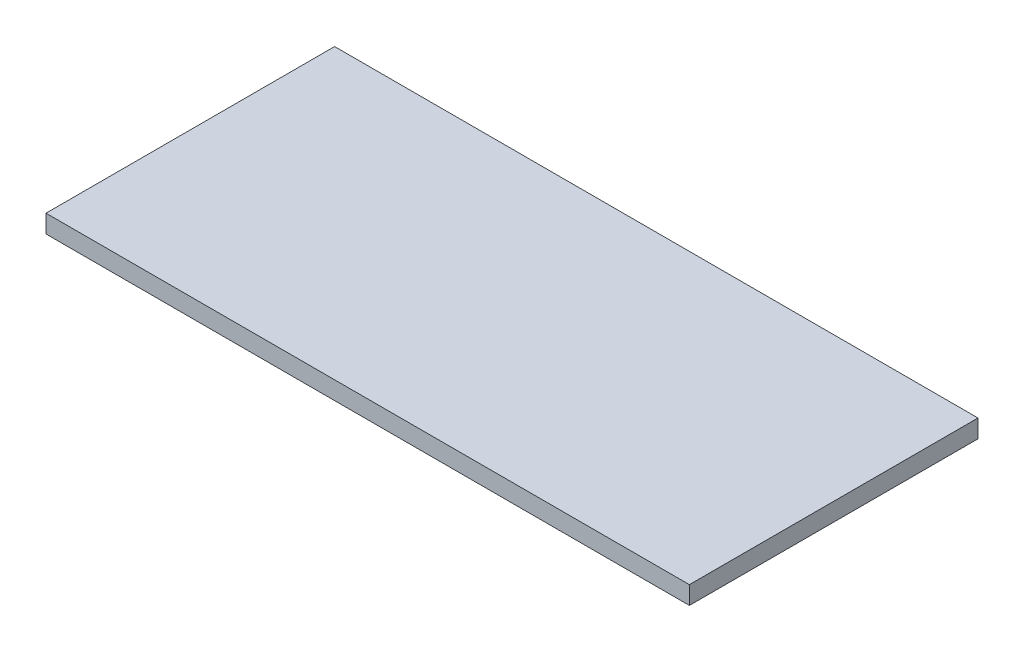
ISO-10303-21;
HEADER;
FILE_DESCRIPTION(('STEP AP214'),'2;1');
FILE_NAME('part.step','',(''),(''),'','','');
FILE_SCHEMA(('AUTOMOTIVE_DESIGN { 1 0 10303 214 1 1 1 1 }'));
ENDSEC;
DATA;
#1=APPLICATION_CONTEXT('core data for automotive mechanical design processes');
#2=APPLICATION_PROTOCOL_DEFINITION('international standard','automotive_design',2000,#1);
#3=PRODUCT_CONTEXT('',#1,'mechanical');
#4=PRODUCT('Part','Part','',(#3));
#5=PRODUCT_RELATED_PRODUCT_CATEGORY('part','',(#4));
#6=PRODUCT_DEFINITION_FORMATION('','',#4);
#7=PRODUCT_DEFINITION_CONTEXT('part definition',#1,'design');
#8=PRODUCT_DEFINITION('design','',#6,#7);
#9=PRODUCT_DEFINITION_SHAPE('','',#8);
#10=(LENGTH_UNIT() NAMED_UNIT(*) SI_UNIT(.MILLI.,.METRE.));
#11=(NAMED_UNIT(*) PLANE_ANGLE_UNIT() SI_UNIT($,.RADIAN.));
#12=(NAMED_UNIT(*) SI_UNIT($,.STERADIAN.) SOLID_ANGLE_UNIT());
#13=UNCERTAINTY_MEASURE_WITH_UNIT(LENGTH_MEASURE(1.E-05),#10,'distance_accuracy_value','');
#14=(GEOMETRIC_REPRESENTATION_CONTEXT(3) GLOBAL_UNCERTAINTY_ASSIGNED_CONTEXT((#13)) GLOBAL_UNIT_ASSIGNED_CONTEXT((#10,
#11,#12)) REPRESENTATION_CONTEXT('',''));
#15=CARTESIAN_POINT('',(0.,0.,0.));
#16=DIRECTION('',(0.,0.,1.));
#17=DIRECTION('',(1.,0.,0.));
#18=AXIS2_PLACEMENT_3D('',#15,#16,#17);
#19=CARTESIAN_POINT('',(-321.,18.,144.));
#20=DIRECTION('',(1.,0.,0.));
#21=DIRECTION('',(0.,0.,-1.));
#22=AXIS2_PLACEMENT_3D('',#19,#20,#21);
#23=PLANE('',#22);
#24=DIRECTION('',(0.,0.,1.));
#25=VECTOR('',#24,1.);
#26=CARTESIAN_POINT('',(-321.,0.,144.));
#27=LINE('',#26,#25);
#28=CARTESIAN_POINT('',(-321.,0.,-144.));
#29=VERTEX_POINT('',#28);
#30=CARTESIAN_POINT('',(-321.,0.,144.));
#31=VERTEX_POINT('',#30);
#32=EDGE_CURVE('E96',#29,#31,#27,.T.);
#33=ORIENTED_EDGE('',*,*,#32,.T.);
#34=DIRECTION('',(0.,-1.,0.));
#35=VECTOR('',#34,1.);
#36=CARTESIAN_POINT('',(-321.,18.,144.));
#37=LINE('',#36,#35);
#38=CARTESIAN_POINT('',(-321.,18.,144.));
#39=VERTEX_POINT('',#38);
#40=EDGE_CURVE('E11',#39,#31,#37,.T.);
#41=ORIENTED_EDGE('',*,*,#40,.F.);
#42=DIRECTION('',(0.,0.,1.));
#43=VECTOR('',#42,1.);
#44=CARTESIAN_POINT('',(-321.,18.,144.));
#45=LINE('',#44,#43);
#46=CARTESIAN_POINT('',(-321.,18.,-144.));
#47=VERTEX_POINT('',#46);
#48=EDGE_CURVE('E84',#47,#39,#45,.T.);
#49=ORIENTED_EDGE('',*,*,#48,.F.);
#50=DIRECTION('',(0.,-1.,0.));
#51=VECTOR('',#50,1.);
#52=CARTESIAN_POINT('',(-321.,18.,-144.));
#53=LINE('',#52,#51);
#54=EDGE_CURVE('E92',#47,#29,#53,.T.);
#55=ORIENTED_EDGE('',*,*,#54,.T.);
#56=EDGE_LOOP('',(#33,#41,#49,#55));
#57=FACE_BOUND('',#56,.T.);
#58=ADVANCED_FACE('F33',(#57),#23,.F.);
#59=CARTESIAN_POINT('',(321.,18.,144.));
#60=DIRECTION('',(0.,0.,-1.));
#61=DIRECTION('',(-1.,0.,0.));
#62=AXIS2_PLACEMENT_3D('',#59,#60,#61);
#63=PLANE('',#62);
#64=DIRECTION('',(1.,0.,0.));
#65=VECTOR('',#64,1.);
#66=CARTESIAN_POINT('',(321.,0.,144.));
#67=LINE('',#66,#65);
#68=CARTESIAN_POINT('',(321.,0.,144.));
#69=VERTEX_POINT('',#68);
#70=EDGE_CURVE('E88',#31,#69,#67,.T.);
#71=ORIENTED_EDGE('',*,*,#70,.T.);
#72=DIRECTION('',(0.,-1.,0.));
#73=VECTOR('',#72,1.);
#74=CARTESIAN_POINT('',(321.,18.,144.));
#75=LINE('',#74,#73);
#76=CARTESIAN_POINT('',(321.,18.,144.));
#77=VERTEX_POINT('',#76);
#78=EDGE_CURVE('E41',#77,#69,#75,.T.);
#79=ORIENTED_EDGE('',*,*,#78,.F.);
#80=DIRECTION('',(1.,0.,0.));
#81=VECTOR('',#80,1.);
#82=CARTESIAN_POINT('',(321.,18.,144.));
#83=LINE('',#82,#81);
#84=EDGE_CURVE('E79',#39,#77,#83,.T.);
#85=ORIENTED_EDGE('',*,*,#84,.F.);
#86=ORIENTED_EDGE('',*,*,#40,.T.);
#87=EDGE_LOOP('',(#71,#79,#85,#86));
#88=FACE_BOUND('',#87,.T.);
#89=ADVANCED_FACE('F87',(#88),#63,.F.);
#90=CARTESIAN_POINT('',(321.,18.,144.));
#91=DIRECTION('',(-1.,0.,0.));
#92=DIRECTION('',(0.,0.,1.));
#93=AXIS2_PLACEMENT_3D('',#90,#91,#92);
#94=PLANE('',#93);
#95=DIRECTION('',(0.,0.,-1.));
#96=VECTOR('',#95,1.);
#97=CARTESIAN_POINT('',(321.,0.,144.));
#98=LINE('',#97,#96);
#99=CARTESIAN_POINT('',(321.,0.,-144.));
#100=VERTEX_POINT('',#99);
#101=EDGE_CURVE('E66',#69,#100,#98,.T.);
#102=ORIENTED_EDGE('',*,*,#101,.T.);
#103=DIRECTION('',(0.,-1.,0.));
#104=VECTOR('',#103,1.);
#105=CARTESIAN_POINT('',(321.,18.,-144.));
#106=LINE('',#105,#104);
#107=CARTESIAN_POINT('',(321.,18.,-144.));
#108=VERTEX_POINT('',#107);
#109=EDGE_CURVE('E89',#108,#100,#106,.T.);
#110=ORIENTED_EDGE('',*,*,#109,.F.);
#111=DIRECTION('',(0.,0.,-1.));
#112=VECTOR('',#111,1.);
#113=CARTESIAN_POINT('',(321.,18.,144.));
#114=LINE('',#113,#112);
#115=EDGE_CURVE('E82',#77,#108,#114,.T.);
#116=ORIENTED_EDGE('',*,*,#115,.F.);
#117=ORIENTED_EDGE('',*,*,#78,.T.);
#118=EDGE_LOOP('',(#102,#110,#116,#117));
#119=FACE_BOUND('',#118,.T.);
#120=ADVANCED_FACE('F90',(#119),#94,.F.);
#121=CARTESIAN_POINT('',(321.,18.,-144.));
#122=DIRECTION('',(0.,0.,1.));
#123=DIRECTION('',(1.,0.,0.));
#124=AXIS2_PLACEMENT_3D('',#121,#122,#123);
#125=PLANE('',#124);
#126=DIRECTION('',(-1.,0.,0.));
#127=VECTOR('',#126,1.);
#128=CARTESIAN_POINT('',(321.,0.,-144.));
#129=LINE('',#128,#127);
#130=EDGE_CURVE('E72',#100,#29,#129,.T.);
#131=ORIENTED_EDGE('',*,*,#130,.T.);
#132=ORIENTED_EDGE('',*,*,#54,.F.);
#133=DIRECTION('',(-1.,0.,0.));
#134=VECTOR('',#133,1.);
#135=CARTESIAN_POINT('',(321.,18.,-144.));
#136=LINE('',#135,#134);
#137=EDGE_CURVE('E49',#108,#47,#136,.T.);
#138=ORIENTED_EDGE('',*,*,#137,.F.);
#139=ORIENTED_EDGE('',*,*,#109,.T.);
#140=EDGE_LOOP('',(#131,#132,#138,#139));
#141=FACE_BOUND('',#140,.T.);
#142=ADVANCED_FACE('F103',(#141),#125,.F.);
#143=CARTESIAN_POINT('',(0.,18.,0.));
#144=DIRECTION('',(0.,1.,0.));
#145=DIRECTION('',(0.,0.,1.));
#146=AXIS2_PLACEMENT_3D('',#143,#144,#145);
#147=PLANE('',#146);
#148=ORIENTED_EDGE('',*,*,#48,.T.);
#149=ORIENTED_EDGE('',*,*,#84,.T.);
#150=ORIENTED_EDGE('',*,*,#115,.T.);
#151=ORIENTED_EDGE('',*,*,#137,.T.);
#152=EDGE_LOOP('',(#148,#149,#150,#151));
#153=FACE_BOUND('',#152,.T.);
#154=ADVANCED_FACE('F80',(#153),#147,.T.);
#155=CARTESIAN_POINT('',(0.,0.,0.));
#156=DIRECTION('',(0.,1.,0.));
#157=DIRECTION('',(0.,0.,1.));
#158=AXIS2_PLACEMENT_3D('',#155,#156,#157);
#159=PLANE('',#158);
#160=ORIENTED_EDGE('',*,*,#32,.F.);
#161=ORIENTED_EDGE('',*,*,#130,.F.);
#162=ORIENTED_EDGE('',*,*,#101,.F.);
#163=ORIENTED_EDGE('',*,*,#70,.F.);
#164=EDGE_LOOP('',(#160,#161,#162,#163));
#165=FACE_BOUND('',#164,.T.);
#166=ADVANCED_FACE('F106',(#165),#159,.F.);
#167=CLOSED_SHELL('',(#58,#89,#120,#142,#154,#166));
#168=MANIFOLD_SOLID_BREP('B2',#167);
#169=ADVANCED_BREP_SHAPE_REPRESENTATION('',(#18,#168),#14);
#170=SHAPE_DEFINITION_REPRESENTATION(#9,#169);
ENDSEC;
END-ISO-10303-21;
